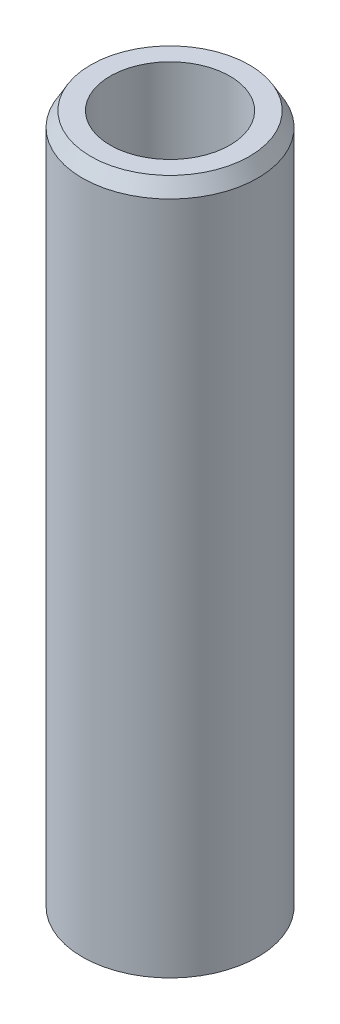
ISO-10303-21;
HEADER;
FILE_DESCRIPTION(('STEP AP214'),'2;1');
FILE_NAME('part.step','',(''),(''),'','','');
FILE_SCHEMA(('AUTOMOTIVE_DESIGN { 1 0 10303 214 1 1 1 1 }'));
ENDSEC;
DATA;
#1=APPLICATION_CONTEXT('core data for automotive mechanical design processes');
#2=APPLICATION_PROTOCOL_DEFINITION('international standard','automotive_design',2000,#1);
#3=PRODUCT_CONTEXT('',#1,'mechanical');
#4=PRODUCT('Part','Part','',(#3));
#5=PRODUCT_RELATED_PRODUCT_CATEGORY('part','',(#4));
#6=PRODUCT_DEFINITION_FORMATION('','',#4);
#7=PRODUCT_DEFINITION_CONTEXT('part definition',#1,'design');
#8=PRODUCT_DEFINITION('design','',#6,#7);
#9=PRODUCT_DEFINITION_SHAPE('','',#8);
#10=(LENGTH_UNIT() NAMED_UNIT(*) SI_UNIT(.MILLI.,.METRE.));
#11=(NAMED_UNIT(*) PLANE_ANGLE_UNIT() SI_UNIT($,.RADIAN.));
#12=(NAMED_UNIT(*) SI_UNIT($,.STERADIAN.) SOLID_ANGLE_UNIT());
#13=UNCERTAINTY_MEASURE_WITH_UNIT(LENGTH_MEASURE(1.E-05),#10,'distance_accuracy_value','');
#14=(GEOMETRIC_REPRESENTATION_CONTEXT(3) GLOBAL_UNCERTAINTY_ASSIGNED_CONTEXT((#13)) GLOBAL_UNIT_ASSIGNED_CONTEXT((#10,
#11,#12)) REPRESENTATION_CONTEXT('',''));
#15=CARTESIAN_POINT('',(0.,0.,0.));
#16=DIRECTION('',(0.,0.,1.));
#17=DIRECTION('',(1.,0.,0.));
#18=AXIS2_PLACEMENT_3D('',#15,#16,#17);
#19=CARTESIAN_POINT('',(0.,258.423691140989,0.));
#20=DIRECTION('',(0.,-1.,0.));
#21=DIRECTION('',(0.,0.,-1.));
#22=AXIS2_PLACEMENT_3D('',#19,#20,#21);
#23=CYLINDRICAL_SURFACE('',#22,32.5);
#24=CARTESIAN_POINT('',(0.,253.032074983727,0.));
#25=DIRECTION('',(0.,1.,0.));
#26=DIRECTION('',(0.,0.,1.));
#27=AXIS2_PLACEMENT_3D('',#24,#25,#26);
#28=CIRCLE('',#27,32.5);
#29=CARTESIAN_POINT('',(0.,253.032074983727,32.5));
#30=VERTEX_POINT('',#29);
#31=EDGE_CURVE('E50',#30,#30,#28,.F.);
#32=ORIENTED_EDGE('',*,*,#31,.T.);
#33=EDGE_LOOP('',(#32));
#34=FACE_BOUND('',#33,.T.);
#35=CARTESIAN_POINT('',(0.,3.1128510397625,0.));
#36=DIRECTION('',(0.,1.,0.));
#37=DIRECTION('',(0.,0.,1.));
#38=AXIS2_PLACEMENT_3D('',#35,#36,#37);
#39=CIRCLE('',#38,32.5);
#40=CARTESIAN_POINT('',(0.,3.1128510397625,32.5));
#41=VERTEX_POINT('',#40);
#42=EDGE_CURVE('E51',#41,#41,#39,.T.);
#43=ORIENTED_EDGE('',*,*,#42,.T.);
#44=EDGE_LOOP('',(#43));
#45=FACE_BOUND('',#44,.T.);
#46=ADVANCED_FACE('F39',(#34,#45),#23,.T.);
#47=CARTESIAN_POINT('',(0.,258.423691140989,0.));
#48=DIRECTION('',(0.,1.,0.));
#49=DIRECTION('',(0.,0.,1.));
#50=AXIS2_PLACEMENT_3D('',#47,#48,#49);
#51=PLANE('',#50);
#52=CARTESIAN_POINT('',(0.,258.423691140989,0.));
#53=DIRECTION('',(0.,1.,0.));
#54=DIRECTION('',(0.,0.,1.));
#55=AXIS2_PLACEMENT_3D('',#52,#53,#54);
#56=CIRCLE('',#55,29.3871489602376);
#57=CARTESIAN_POINT('',(0.,258.423691140989,29.3871489602376));
#58=VERTEX_POINT('',#57);
#59=EDGE_CURVE('E54',#58,#58,#56,.T.);
#60=ORIENTED_EDGE('',*,*,#59,.T.);
#61=EDGE_LOOP('',(#60));
#62=FACE_BOUND('',#61,.T.);
#63=CARTESIAN_POINT('',(0.,258.423691140989,0.));
#64=DIRECTION('',(0.,1.,0.));
#65=DIRECTION('',(0.,0.,1.));
#66=AXIS2_PLACEMENT_3D('',#63,#64,#65);
#67=CIRCLE('',#66,22.1720164675322);
#68=CARTESIAN_POINT('',(0.,258.423691140989,22.1720164675322));
#69=VERTEX_POINT('',#68);
#70=EDGE_CURVE('E58',#69,#69,#67,.T.);
#71=ORIENTED_EDGE('',*,*,#70,.F.);
#72=EDGE_LOOP('',(#71));
#73=FACE_BOUND('',#72,.T.);
#74=ADVANCED_FACE('F69',(#62,#73),#51,.T.);
#75=CARTESIAN_POINT('',(0.,0.,0.));
#76=DIRECTION('',(0.,1.,0.));
#77=DIRECTION('',(0.,0.,1.));
#78=AXIS2_PLACEMENT_3D('',#75,#76,#77);
#79=PLANE('',#78);
#80=CARTESIAN_POINT('',(0.,0.,0.));
#81=DIRECTION('',(0.,1.,0.));
#82=DIRECTION('',(0.,0.,1.));
#83=AXIS2_PLACEMENT_3D('',#80,#81,#82);
#84=CIRCLE('',#83,27.1083838427377);
#85=CARTESIAN_POINT('',(0.,0.,27.1083838427377));
#86=VERTEX_POINT('',#85);
#87=EDGE_CURVE('E10',#86,#86,#84,.F.);
#88=ORIENTED_EDGE('',*,*,#87,.T.);
#89=EDGE_LOOP('',(#88));
#90=FACE_BOUND('',#89,.T.);
#91=CARTESIAN_POINT('',(0.,0.,0.));
#92=DIRECTION('',(0.,1.,0.));
#93=DIRECTION('',(0.,0.,1.));
#94=AXIS2_PLACEMENT_3D('',#91,#92,#93);
#95=CIRCLE('',#94,22.1720164675322);
#96=CARTESIAN_POINT('',(0.,0.,22.1720164675322));
#97=VERTEX_POINT('',#96);
#98=EDGE_CURVE('E63',#97,#97,#95,.T.);
#99=ORIENTED_EDGE('',*,*,#98,.T.);
#100=EDGE_LOOP('',(#99));
#101=FACE_BOUND('',#100,.T.);
#102=ADVANCED_FACE('F75',(#90,#101),#79,.F.);
#103=CARTESIAN_POINT('',(0.,258.423691140989,0.));
#104=DIRECTION('',(0.,-1.,0.));
#105=DIRECTION('',(0.,0.,-1.));
#106=AXIS2_PLACEMENT_3D('',#103,#104,#105);
#107=CYLINDRICAL_SURFACE('',#106,22.1720164675322);
#108=ORIENTED_EDGE('',*,*,#70,.T.);
#109=EDGE_LOOP('',(#108));
#110=FACE_BOUND('',#109,.T.);
#111=ORIENTED_EDGE('',*,*,#98,.F.);
#112=EDGE_LOOP('',(#111));
#113=FACE_BOUND('',#112,.T.);
#114=ADVANCED_FACE('F70',(#110,#113),#107,.F.);
#115=CARTESIAN_POINT('',(0.,258.423691140989,0.));
#116=DIRECTION('',(0.,-1.,0.));
#117=DIRECTION('',(0.,0.,-1.));
#118=AXIS2_PLACEMENT_3D('',#115,#116,#117);
#119=CONICAL_SURFACE('',#118,29.3871489602376,0.523598775598302);
#120=ORIENTED_EDGE('',*,*,#31,.F.);
#121=EDGE_LOOP('',(#120));
#122=FACE_BOUND('',#121,.T.);
#123=ORIENTED_EDGE('',*,*,#59,.F.);
#124=EDGE_LOOP('',(#123));
#125=FACE_BOUND('',#124,.T.);
#126=ADVANCED_FACE('F81',(#122,#125),#119,.T.);
#127=CARTESIAN_POINT('',(0.,3.1128510397625,0.));
#128=DIRECTION('',(0.,1.,0.));
#129=DIRECTION('',(0.,0.,1.));
#130=AXIS2_PLACEMENT_3D('',#127,#128,#129);
#131=CONICAL_SURFACE('',#130,32.5,1.0471975511966);
#132=ORIENTED_EDGE('',*,*,#87,.F.);
#133=EDGE_LOOP('',(#132));
#134=FACE_BOUND('',#133,.T.);
#135=ORIENTED_EDGE('',*,*,#42,.F.);
#136=EDGE_LOOP('',(#135));
#137=FACE_BOUND('',#136,.T.);
#138=ADVANCED_FACE('F45',(#134,#137),#131,.T.);
#139=CLOSED_SHELL('',(#46,#74,#102,#114,#126,#138));
#140=MANIFOLD_SOLID_BREP('B2',#139);
#141=ADVANCED_BREP_SHAPE_REPRESENTATION('',(#18,#140),#14);
#142=SHAPE_DEFINITION_REPRESENTATION(#9,#141);
ENDSEC;
END-ISO-10303-21;
